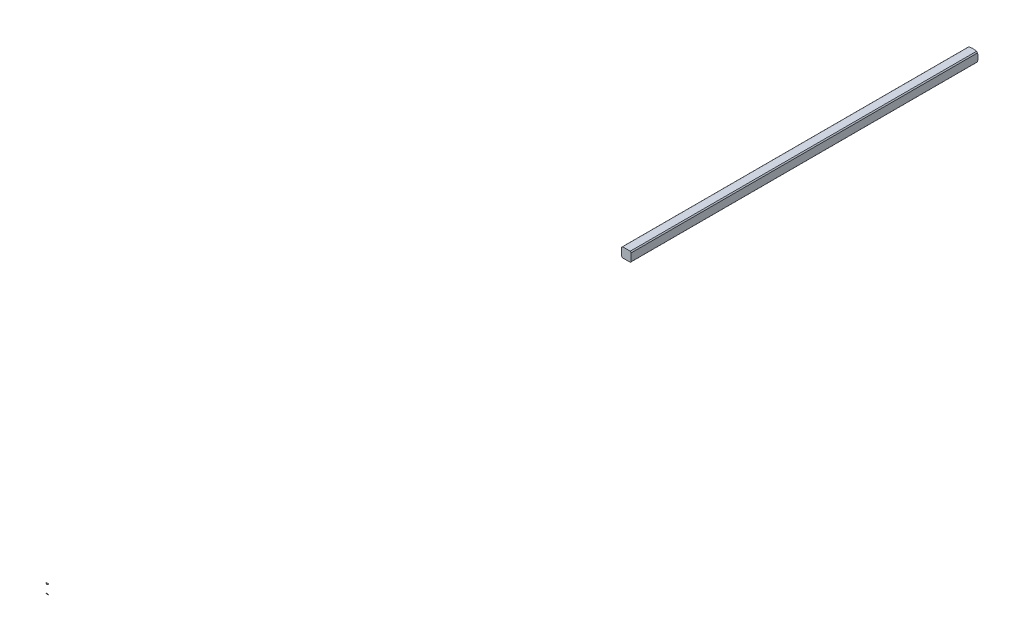
ISO-10303-21;
HEADER;
FILE_DESCRIPTION(('STEP AP214'),'2;1');
FILE_NAME('part.step','',(''),(''),'','','');
FILE_SCHEMA(('AUTOMOTIVE_DESIGN { 1 0 10303 214 1 1 1 1 }'));
ENDSEC;
DATA;
#1=APPLICATION_CONTEXT('core data for automotive mechanical design processes');
#2=APPLICATION_PROTOCOL_DEFINITION('international standard','automotive_design',2000,#1);
#3=PRODUCT_CONTEXT('',#1,'mechanical');
#4=PRODUCT('Part','Part','',(#3));
#5=PRODUCT_RELATED_PRODUCT_CATEGORY('part','',(#4));
#6=PRODUCT_DEFINITION_FORMATION('','',#4);
#7=PRODUCT_DEFINITION_CONTEXT('part definition',#1,'design');
#8=PRODUCT_DEFINITION('design','',#6,#7);
#9=PRODUCT_DEFINITION_SHAPE('','',#8);
#10=(LENGTH_UNIT() NAMED_UNIT(*) SI_UNIT(.MILLI.,.METRE.));
#11=(NAMED_UNIT(*) PLANE_ANGLE_UNIT() SI_UNIT($,.RADIAN.));
#12=(NAMED_UNIT(*) SI_UNIT($,.STERADIAN.) SOLID_ANGLE_UNIT());
#13=UNCERTAINTY_MEASURE_WITH_UNIT(LENGTH_MEASURE(1.E-05),#10,'distance_accuracy_value','');
#14=(GEOMETRIC_REPRESENTATION_CONTEXT(3) GLOBAL_UNCERTAINTY_ASSIGNED_CONTEXT((#13)) GLOBAL_UNIT_ASSIGNED_CONTEXT((#10,
#11,#12)) REPRESENTATION_CONTEXT('',''));
#15=CARTESIAN_POINT('',(0.,0.,0.));
#16=DIRECTION('',(0.,0.,1.));
#17=DIRECTION('',(1.,0.,0.));
#18=AXIS2_PLACEMENT_3D('',#15,#16,#17);
#19=CARTESIAN_POINT('',(0.,0.,-4.91912226376204));
#20=DIRECTION('',(0.,0.,-1.));
#21=DIRECTION('',(-1.,0.,0.));
#22=AXIS2_PLACEMENT_3D('',#19,#20,#21);
#23=SPHERICAL_SURFACE('',#22,5.08);
#24=CARTESIAN_POINT('',(0.,-1.7260493401115,-0.166227772370093));
#25=DIRECTION('',(0.,0.341345507381833,-0.93993789400696));
#26=DIRECTION('',(0.,0.93993789400696,0.341345507381833));
#27=AXIS2_PLACEMENT_3D('',#24,#25,#26);
#28=CIRCLE('',#27,0.486978058229274);
#29=CARTESIAN_POINT('',(0.464133694973146,-1.5875,-0.115912538672931));
#30=VERTEX_POINT('',#29);
#31=CARTESIAN_POINT('',(-0.464133694973143,-1.5875,-0.115912538672932));
#32=VERTEX_POINT('',#31);
#33=EDGE_CURVE('E54',#30,#32,#28,.F.);
#34=ORIENTED_EDGE('',*,*,#33,.T.);
#35=CARTESIAN_POINT('',(0.,-1.5875,-4.91912226376204));
#36=DIRECTION('',(0.,-1.,0.));
#37=DIRECTION('',(0.,0.,-1.));
#38=AXIS2_PLACEMENT_3D('',#35,#36,#37);
#39=CIRCLE('',#38,4.82558221875869);
#40=EDGE_CURVE('E63',#30,#32,#39,.T.);
#41=ORIENTED_EDGE('',*,*,#40,.F.);
#42=EDGE_LOOP('',(#34,#41));
#43=FACE_BOUND('',#42,.T.);
#44=ADVANCED_FACE('F46',(#43),#23,.T.);
#45=CARTESIAN_POINT('',(-1.5875,-1.5875,-152.4));
#46=DIRECTION('',(0.,1.,0.));
#47=DIRECTION('',(0.,0.,-1.));
#48=AXIS2_PLACEMENT_3D('',#45,#46,#47);
#49=PLANE('',#48);
#50=ORIENTED_EDGE('',*,*,#40,.T.);
#51=DIRECTION('',(1.,0.,0.));
#52=VECTOR('',#51,1.);
#53=CARTESIAN_POINT('',(-1.5875,-1.5875,-0.115912538672932));
#54=LINE('',#53,#52);
#55=EDGE_CURVE('E12',#32,#30,#54,.T.);
#56=ORIENTED_EDGE('',*,*,#55,.T.);
#57=EDGE_LOOP('',(#50,#56));
#58=FACE_BOUND('',#57,.T.);
#59=ADVANCED_FACE('F64',(#58),#49,.F.);
#60=CARTESIAN_POINT('',(-1.5875,-1.5875,-0.115912538672932));
#61=DIRECTION('',(0.,-0.341345507381833,0.93993789400696));
#62=DIRECTION('',(0.,0.93993789400696,0.341345507381833));
#63=AXIS2_PLACEMENT_3D('',#60,#61,#62);
#64=PLANE('',#63);
#65=ORIENTED_EDGE('',*,*,#33,.F.);
#66=ORIENTED_EDGE('',*,*,#55,.F.);
#67=EDGE_LOOP('',(#65,#66));
#68=FACE_BOUND('',#67,.T.);
#69=ADVANCED_FACE('F61',(#68),#64,.F.);
#70=CLOSED_SHELL('',(#44,#59,#69));
#71=MANIFOLD_SOLID_BREP('B2',#70);
#72=CARTESIAN_POINT('',(0.,0.,-4.91912226376204));
#73=DIRECTION('',(0.,0.,-1.));
#74=DIRECTION('',(-1.,0.,0.));
#75=AXIS2_PLACEMENT_3D('',#72,#73,#74);
#76=SPHERICAL_SURFACE('',#75,5.08);
#77=CARTESIAN_POINT('',(0.,1.72604934011151,-0.166227772370097));
#78=DIRECTION('',(0.,-0.341345507381835,-0.939937894006959));
#79=DIRECTION('',(0.,0.939937894006959,-0.341345507381835));
#80=AXIS2_PLACEMENT_3D('',#77,#78,#79);
#81=CIRCLE('',#80,0.486978058229285);
#82=CARTESIAN_POINT('',(-0.46413369497315,1.5875,-0.115912538672932));
#83=VERTEX_POINT('',#82);
#84=CARTESIAN_POINT('',(0.46413369497315,1.5875,-0.115912538672932));
#85=VERTEX_POINT('',#84);
#86=EDGE_CURVE('E112',#83,#85,#81,.F.);
#87=ORIENTED_EDGE('',*,*,#86,.T.);
#88=CARTESIAN_POINT('',(0.,1.5875,-4.91912226376204));
#89=DIRECTION('',(0.,1.,0.));
#90=DIRECTION('',(0.,0.,1.));
#91=AXIS2_PLACEMENT_3D('',#88,#89,#90);
#92=CIRCLE('',#91,4.82558221875869);
#93=EDGE_CURVE('E44',#83,#85,#92,.T.);
#94=ORIENTED_EDGE('',*,*,#93,.F.);
#95=EDGE_LOOP('',(#87,#94));
#96=FACE_BOUND('',#95,.T.);
#97=ADVANCED_FACE('F104',(#96),#76,.T.);
#98=CARTESIAN_POINT('',(-1.5875,1.5875,-152.4));
#99=DIRECTION('',(0.,-1.,0.));
#100=DIRECTION('',(0.,0.,1.));
#101=AXIS2_PLACEMENT_3D('',#98,#99,#100);
#102=PLANE('',#101);
#103=ORIENTED_EDGE('',*,*,#93,.T.);
#104=DIRECTION('',(1.,0.,0.));
#105=VECTOR('',#104,1.);
#106=CARTESIAN_POINT('',(-1.5875,1.5875,-0.115912538672932));
#107=LINE('',#106,#105);
#108=EDGE_CURVE('E118',#83,#85,#107,.T.);
#109=ORIENTED_EDGE('',*,*,#108,.F.);
#110=EDGE_LOOP('',(#103,#109));
#111=FACE_BOUND('',#110,.T.);
#112=ADVANCED_FACE('F106',(#111),#102,.F.);
#113=CARTESIAN_POINT('',(-1.5875,1.26832020963187,0.));
#114=DIRECTION('',(0.,0.341345507381835,0.939937894006959));
#115=DIRECTION('',(0.,0.939937894006959,-0.341345507381835));
#116=AXIS2_PLACEMENT_3D('',#113,#114,#115);
#117=PLANE('',#116);
#118=ORIENTED_EDGE('',*,*,#86,.F.);
#119=ORIENTED_EDGE('',*,*,#108,.T.);
#120=EDGE_LOOP('',(#118,#119));
#121=FACE_BOUND('',#120,.T.);
#122=ADVANCED_FACE('F124',(#121),#117,.F.);
#123=CLOSED_SHELL('',(#97,#112,#122));
#124=MANIFOLD_SOLID_BREP('B6',#123);
#125=CARTESIAN_POINT('',(-1.5875,-1.5875,-152.4));
#126=DIRECTION('',(0.,1.,0.));
#127=DIRECTION('',(0.,0.,-1.));
#128=AXIS2_PLACEMENT_3D('',#125,#126,#127);
#129=PLANE('',#128);
#130=DIRECTION('',(0.,0.,1.));
#131=VECTOR('',#130,1.);
#132=CARTESIAN_POINT('',(-1.26841150657032,-1.5875,-152.4));
#133=LINE('',#132,#131);
#134=CARTESIAN_POINT('',(-1.26841150657032,-1.5875,-190.615912538673));
#135=VERTEX_POINT('',#134);
#136=CARTESIAN_POINT('',(-1.26841150657032,-1.5875,-304.536774642313));
#137=VERTEX_POINT('',#136);
#138=EDGE_CURVE('E222',#135,#137,#133,.F.);
#139=ORIENTED_EDGE('',*,*,#138,.T.);
#140=CARTESIAN_POINT('',(0.,-1.5875,-299.880877736238));
#141=DIRECTION('',(0.,1.,0.));
#142=DIRECTION('',(0.,0.,1.));
#143=AXIS2_PLACEMENT_3D('',#140,#141,#142);
#144=CIRCLE('',#143,4.82558221875869);
#145=CARTESIAN_POINT('',(1.26841150657032,-1.5875,-304.536774642313));
#146=VERTEX_POINT('',#145);
#147=EDGE_CURVE('E240',#146,#137,#144,.T.);
#148=ORIENTED_EDGE('',*,*,#147,.F.);
#149=DIRECTION('',(0.,0.,1.));
#150=VECTOR('',#149,1.);
#151=CARTESIAN_POINT('',(1.26841150657032,-1.5875,-152.4));
#152=LINE('',#151,#150);
#153=CARTESIAN_POINT('',(1.26841150657032,-1.5875,-190.615912538673));
#154=VERTEX_POINT('',#153);
#155=EDGE_CURVE('E218',#146,#154,#152,.T.);
#156=ORIENTED_EDGE('',*,*,#155,.T.);
#157=DIRECTION('',(1.,0.,0.));
#158=VECTOR('',#157,1.);
#159=CARTESIAN_POINT('',(-1.5875,-1.5875,-190.615912538673));
#160=LINE('',#159,#158);
#161=EDGE_CURVE('E244',#135,#154,#160,.T.);
#162=ORIENTED_EDGE('',*,*,#161,.F.);
#163=EDGE_LOOP('',(#139,#148,#156,#162));
#164=FACE_BOUND('',#163,.T.);
#165=ADVANCED_FACE('F153',(#164),#129,.F.);
#166=CARTESIAN_POINT('',(-1.5875,1.5875,-152.4));
#167=DIRECTION('',(0.,-1.,0.));
#168=DIRECTION('',(0.,0.,1.));
#169=AXIS2_PLACEMENT_3D('',#166,#167,#168);
#170=PLANE('',#169);
#171=DIRECTION('',(0.,0.,1.));
#172=VECTOR('',#171,1.);
#173=CARTESIAN_POINT('',(1.26841150657032,1.5875,-152.4));
#174=LINE('',#173,#172);
#175=CARTESIAN_POINT('',(1.26841150657032,1.5875,-190.615912538673));
#176=VERTEX_POINT('',#175);
#177=CARTESIAN_POINT('',(1.26841150657032,1.5875,-304.536774642313));
#178=VERTEX_POINT('',#177);
#179=EDGE_CURVE('E201',#176,#178,#174,.F.);
#180=ORIENTED_EDGE('',*,*,#179,.T.);
#181=CARTESIAN_POINT('',(0.,1.5875,-299.880877736238));
#182=DIRECTION('',(0.,-1.,0.));
#183=DIRECTION('',(0.,0.,-1.));
#184=AXIS2_PLACEMENT_3D('',#181,#182,#183);
#185=CIRCLE('',#184,4.82558221875869);
#186=CARTESIAN_POINT('',(-1.26841150657032,1.5875,-304.536774642313));
#187=VERTEX_POINT('',#186);
#188=EDGE_CURVE('E243',#187,#178,#185,.T.);
#189=ORIENTED_EDGE('',*,*,#188,.F.);
#190=DIRECTION('',(0.,0.,1.));
#191=VECTOR('',#190,1.);
#192=CARTESIAN_POINT('',(-1.26841150657032,1.5875,-152.4));
#193=LINE('',#192,#191);
#194=CARTESIAN_POINT('',(-1.26841150657032,1.5875,-190.615912538673));
#195=VERTEX_POINT('',#194);
#196=EDGE_CURVE('E216',#187,#195,#193,.T.);
#197=ORIENTED_EDGE('',*,*,#196,.T.);
#198=DIRECTION('',(1.,0.,0.));
#199=VECTOR('',#198,1.);
#200=CARTESIAN_POINT('',(-1.5875,1.5875,-190.615912538673));
#201=LINE('',#200,#199);
#202=EDGE_CURVE('E204',#195,#176,#201,.T.);
#203=ORIENTED_EDGE('',*,*,#202,.T.);
#204=EDGE_LOOP('',(#180,#189,#197,#203));
#205=FACE_BOUND('',#204,.T.);
#206=ADVANCED_FACE('F277',(#205),#170,.F.);
#207=CARTESIAN_POINT('',(-1.5875,-1.5875,-152.4));
#208=DIRECTION('',(1.,0.,0.));
#209=DIRECTION('',(0.,0.,1.));
#210=AXIS2_PLACEMENT_3D('',#207,#208,#209);
#211=PLANE('',#210);
#212=DIRECTION('',(0.,0.,1.));
#213=VECTOR('',#212,1.);
#214=CARTESIAN_POINT('',(-1.5875,1.26841150657032,-152.4));
#215=LINE('',#214,#213);
#216=CARTESIAN_POINT('',(-1.5875,1.26841150657032,-190.615912538673));
#217=VERTEX_POINT('',#216);
#218=CARTESIAN_POINT('',(-1.5875,1.26841150657032,-304.536774642313));
#219=VERTEX_POINT('',#218);
#220=EDGE_CURVE('E213',#217,#219,#215,.F.);
#221=ORIENTED_EDGE('',*,*,#220,.T.);
#222=CARTESIAN_POINT('',(-1.5875,0.,-299.880877736238));
#223=DIRECTION('',(1.,0.,0.));
#224=DIRECTION('',(0.,0.,-1.));
#225=AXIS2_PLACEMENT_3D('',#222,#223,#224);
#226=CIRCLE('',#225,4.82558221875869);
#227=CARTESIAN_POINT('',(-1.5875,-1.26841150657032,-304.536774642313));
#228=VERTEX_POINT('',#227);
#229=EDGE_CURVE('E246',#228,#219,#226,.T.);
#230=ORIENTED_EDGE('',*,*,#229,.F.);
#231=DIRECTION('',(0.,0.,1.));
#232=VECTOR('',#231,1.);
#233=CARTESIAN_POINT('',(-1.5875,-1.26841150657032,-152.4));
#234=LINE('',#233,#232);
#235=CARTESIAN_POINT('',(-1.5875,-1.26841150657032,-190.615912538673));
#236=VERTEX_POINT('',#235);
#237=EDGE_CURVE('E226',#228,#236,#234,.T.);
#238=ORIENTED_EDGE('',*,*,#237,.T.);
#239=DIRECTION('',(0.,-1.,0.));
#240=VECTOR('',#239,1.);
#241=CARTESIAN_POINT('',(-1.5875,1.5875,-190.615912538673));
#242=LINE('',#241,#240);
#243=EDGE_CURVE('E156',#217,#236,#242,.T.);
#244=ORIENTED_EDGE('',*,*,#243,.F.);
#245=EDGE_LOOP('',(#221,#230,#238,#244));
#246=FACE_BOUND('',#245,.T.);
#247=ADVANCED_FACE('F311',(#246),#211,.F.);
#248=CARTESIAN_POINT('',(1.5875,-1.5875,-152.4));
#249=DIRECTION('',(-1.,0.,0.));
#250=DIRECTION('',(0.,0.,-1.));
#251=AXIS2_PLACEMENT_3D('',#248,#249,#250);
#252=PLANE('',#251);
#253=DIRECTION('',(0.,0.,1.));
#254=VECTOR('',#253,1.);
#255=CARTESIAN_POINT('',(1.5875,-1.26841150657032,-152.4));
#256=LINE('',#255,#254);
#257=CARTESIAN_POINT('',(1.5875,-1.26841150657032,-190.615912538673));
#258=VERTEX_POINT('',#257);
#259=CARTESIAN_POINT('',(1.5875,-1.26841150657032,-304.536774642313));
#260=VERTEX_POINT('',#259);
#261=EDGE_CURVE('E224',#258,#260,#256,.F.);
#262=ORIENTED_EDGE('',*,*,#261,.T.);
#263=CARTESIAN_POINT('',(1.5875,0.,-299.880877736238));
#264=DIRECTION('',(-1.,0.,0.));
#265=DIRECTION('',(0.,0.,1.));
#266=AXIS2_PLACEMENT_3D('',#263,#264,#265);
#267=CIRCLE('',#266,4.82558221875869);
#268=CARTESIAN_POINT('',(1.5875,1.26841150657032,-304.536774642313));
#269=VERTEX_POINT('',#268);
#270=EDGE_CURVE('E212',#269,#260,#267,.T.);
#271=ORIENTED_EDGE('',*,*,#270,.F.);
#272=DIRECTION('',(0.,0.,1.));
#273=VECTOR('',#272,1.);
#274=CARTESIAN_POINT('',(1.5875,1.26841150657032,-152.4));
#275=LINE('',#274,#273);
#276=CARTESIAN_POINT('',(1.5875,1.26841150657032,-190.615912538673));
#277=VERTEX_POINT('',#276);
#278=EDGE_CURVE('E198',#269,#277,#275,.T.);
#279=ORIENTED_EDGE('',*,*,#278,.T.);
#280=DIRECTION('',(0.,-1.,0.));
#281=VECTOR('',#280,1.);
#282=CARTESIAN_POINT('',(1.5875,1.5875,-190.615912538673));
#283=LINE('',#282,#281);
#284=EDGE_CURVE('E162',#277,#258,#283,.T.);
#285=ORIENTED_EDGE('',*,*,#284,.T.);
#286=EDGE_LOOP('',(#262,#271,#279,#285));
#287=FACE_BOUND('',#286,.T.);
#288=ADVANCED_FACE('F210',(#287),#252,.F.);
#289=CARTESIAN_POINT('',(0.,0.,-152.4));
#290=DIRECTION('',(0.,0.,1.));
#291=DIRECTION('',(-1.,0.,0.));
#292=AXIS2_PLACEMENT_3D('',#289,#290,#291);
#293=CYLINDRICAL_SURFACE('',#292,2.032);
#294=CARTESIAN_POINT('',(0.,0.,-190.615912538673));
#295=DIRECTION('',(0.,0.,1.));
#296=DIRECTION('',(1.,0.,0.));
#297=AXIS2_PLACEMENT_3D('',#294,#295,#296);
#298=CIRCLE('',#297,2.032);
#299=EDGE_CURVE('E171',#135,#236,#298,.F.);
#300=ORIENTED_EDGE('',*,*,#299,.T.);
#301=ORIENTED_EDGE('',*,*,#237,.F.);
#302=CARTESIAN_POINT('',(0.,0.,-304.536774642313));
#303=DIRECTION('',(0.,0.,1.));
#304=DIRECTION('',(1.,0.,0.));
#305=AXIS2_PLACEMENT_3D('',#302,#303,#304);
#306=CIRCLE('',#305,2.032);
#307=EDGE_CURVE('E233',#228,#137,#306,.T.);
#308=ORIENTED_EDGE('',*,*,#307,.T.);
#309=ORIENTED_EDGE('',*,*,#138,.F.);
#310=EDGE_LOOP('',(#300,#301,#308,#309));
#311=FACE_BOUND('',#310,.T.);
#312=ADVANCED_FACE('F298',(#311),#293,.T.);
#313=CARTESIAN_POINT('',(0.,0.,-190.615912538673));
#314=DIRECTION('',(0.,0.,1.));
#315=DIRECTION('',(1.,0.,0.));
#316=AXIS2_PLACEMENT_3D('',#313,#314,#315);
#317=CIRCLE('',#316,2.032);
#318=EDGE_CURVE('E102',#258,#154,#317,.F.);
#319=ORIENTED_EDGE('',*,*,#318,.T.);
#320=ORIENTED_EDGE('',*,*,#155,.F.);
#321=CARTESIAN_POINT('',(0.,0.,-304.536774642313));
#322=DIRECTION('',(0.,0.,1.));
#323=DIRECTION('',(1.,0.,0.));
#324=AXIS2_PLACEMENT_3D('',#321,#322,#323);
#325=CIRCLE('',#324,2.032);
#326=EDGE_CURVE('E237',#146,#260,#325,.T.);
#327=ORIENTED_EDGE('',*,*,#326,.T.);
#328=ORIENTED_EDGE('',*,*,#261,.F.);
#329=EDGE_LOOP('',(#319,#320,#327,#328));
#330=FACE_BOUND('',#329,.T.);
#331=ADVANCED_FACE('F296',(#330),#293,.T.);
#332=CARTESIAN_POINT('',(0.,0.,-190.615912538673));
#333=DIRECTION('',(0.,0.,1.));
#334=DIRECTION('',(1.,0.,0.));
#335=AXIS2_PLACEMENT_3D('',#332,#333,#334);
#336=CIRCLE('',#335,2.032);
#337=EDGE_CURVE('E193',#176,#277,#336,.F.);
#338=ORIENTED_EDGE('',*,*,#337,.T.);
#339=ORIENTED_EDGE('',*,*,#278,.F.);
#340=CARTESIAN_POINT('',(0.,0.,-304.536774642313));
#341=DIRECTION('',(0.,0.,1.));
#342=DIRECTION('',(1.,0.,0.));
#343=AXIS2_PLACEMENT_3D('',#340,#341,#342);
#344=CIRCLE('',#343,2.032);
#345=EDGE_CURVE('E234',#269,#178,#344,.T.);
#346=ORIENTED_EDGE('',*,*,#345,.T.);
#347=ORIENTED_EDGE('',*,*,#179,.F.);
#348=EDGE_LOOP('',(#338,#339,#346,#347));
#349=FACE_BOUND('',#348,.T.);
#350=ADVANCED_FACE('F194',(#349),#293,.T.);
#351=CARTESIAN_POINT('',(0.,0.,-190.615912538673));
#352=DIRECTION('',(0.,0.,1.));
#353=DIRECTION('',(1.,0.,0.));
#354=AXIS2_PLACEMENT_3D('',#351,#352,#353);
#355=CIRCLE('',#354,2.032);
#356=EDGE_CURVE('E254',#217,#195,#355,.F.);
#357=ORIENTED_EDGE('',*,*,#356,.T.);
#358=ORIENTED_EDGE('',*,*,#196,.F.);
#359=CARTESIAN_POINT('',(0.,0.,-304.536774642313));
#360=DIRECTION('',(0.,0.,1.));
#361=DIRECTION('',(1.,0.,0.));
#362=AXIS2_PLACEMENT_3D('',#359,#360,#361);
#363=CIRCLE('',#362,2.032);
#364=EDGE_CURVE('E230',#187,#219,#363,.T.);
#365=ORIENTED_EDGE('',*,*,#364,.T.);
#366=ORIENTED_EDGE('',*,*,#220,.F.);
#367=EDGE_LOOP('',(#357,#358,#365,#366));
#368=FACE_BOUND('',#367,.T.);
#369=ADVANCED_FACE('F272',(#368),#293,.T.);
#370=CARTESIAN_POINT('',(0.,0.,-299.880877736238));
#371=DIRECTION('',(0.,0.,1.));
#372=DIRECTION('',(-1.,0.,0.));
#373=AXIS2_PLACEMENT_3D('',#370,#371,#372);
#374=SPHERICAL_SURFACE('',#373,5.08);
#375=CARTESIAN_POINT('',(0.,0.,-304.8));
#376=DIRECTION('',(0.,0.,-1.));
#377=DIRECTION('',(-1.,0.,0.));
#378=AXIS2_PLACEMENT_3D('',#375,#376,#377);
#379=CIRCLE('',#378,1.26832020963187);
#380=CARTESIAN_POINT('',(-1.26832020963187,0.,-304.8));
#381=VERTEX_POINT('',#380);
#382=EDGE_CURVE('E228',#381,#381,#379,.T.);
#383=ORIENTED_EDGE('',*,*,#382,.F.);
#384=EDGE_LOOP('',(#383));
#385=FACE_BOUND('',#384,.T.);
#386=ORIENTED_EDGE('',*,*,#147,.T.);
#387=ORIENTED_EDGE('',*,*,#307,.F.);
#388=ORIENTED_EDGE('',*,*,#229,.T.);
#389=ORIENTED_EDGE('',*,*,#364,.F.);
#390=ORIENTED_EDGE('',*,*,#188,.T.);
#391=ORIENTED_EDGE('',*,*,#345,.F.);
#392=ORIENTED_EDGE('',*,*,#270,.T.);
#393=ORIENTED_EDGE('',*,*,#326,.F.);
#394=EDGE_LOOP('',(#386,#387,#388,#389,#390,#391,#392,#393));
#395=FACE_BOUND('',#394,.T.);
#396=ADVANCED_FACE('F283',(#385,#395),#374,.T.);
#397=CARTESIAN_POINT('',(0.,0.,-304.8));
#398=DIRECTION('',(0.,0.,-1.));
#399=DIRECTION('',(-1.,0.,0.));
#400=AXIS2_PLACEMENT_3D('',#397,#398,#399);
#401=PLANE('',#400);
#402=ORIENTED_EDGE('',*,*,#382,.T.);
#403=EDGE_LOOP('',(#402));
#404=FACE_BOUND('',#403,.T.);
#405=ADVANCED_FACE('F320',(#404),#401,.T.);
#406=CARTESIAN_POINT('',(-1.5875,1.5875,-190.615912538673));
#407=DIRECTION('',(0.,0.,-1.));
#408=DIRECTION('',(1.,0.,0.));
#409=AXIS2_PLACEMENT_3D('',#406,#407,#408);
#410=PLANE('',#409);
#411=ORIENTED_EDGE('',*,*,#299,.F.);
#412=ORIENTED_EDGE('',*,*,#161,.T.);
#413=ORIENTED_EDGE('',*,*,#318,.F.);
#414=ORIENTED_EDGE('',*,*,#284,.F.);
#415=ORIENTED_EDGE('',*,*,#337,.F.);
#416=ORIENTED_EDGE('',*,*,#202,.F.);
#417=ORIENTED_EDGE('',*,*,#356,.F.);
#418=ORIENTED_EDGE('',*,*,#243,.T.);
#419=EDGE_LOOP('',(#411,#412,#413,#414,#415,#416,#417,#418));
#420=FACE_BOUND('',#419,.T.);
#421=ADVANCED_FACE('F206',(#420),#410,.F.);
#422=CLOSED_SHELL('',(#165,#206,#247,#288,#312,#331,#350,#369,#396,#405,#421));
#423=MANIFOLD_SOLID_BREP('B38',#422);
#424=ADVANCED_BREP_SHAPE_REPRESENTATION('',(#18,#71,#124,#423),#14);
#425=SHAPE_DEFINITION_REPRESENTATION(#9,#424);
ENDSEC;
END-ISO-10303-21;
